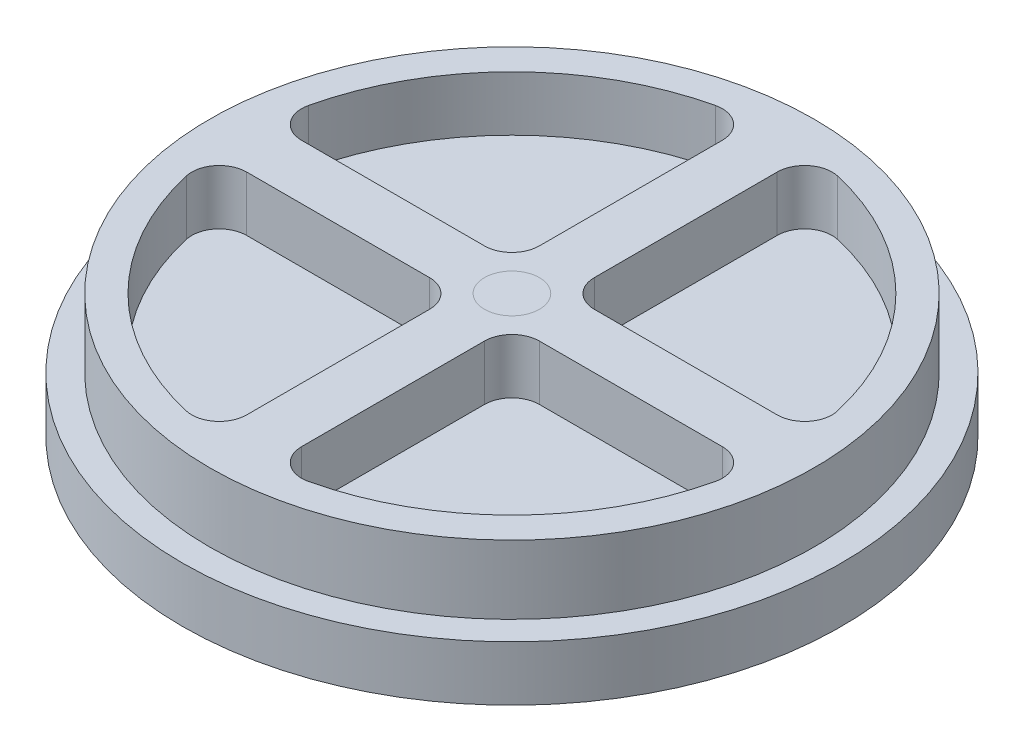
ISO-10303-21;
HEADER;
FILE_DESCRIPTION(('STEP AP214'),'2;1');
FILE_NAME('part.step','',(''),(''),'','','');
FILE_SCHEMA(('AUTOMOTIVE_DESIGN { 1 0 10303 214 1 1 1 1 }'));
ENDSEC;
DATA;
#1=APPLICATION_CONTEXT('core data for automotive mechanical design processes');
#2=APPLICATION_PROTOCOL_DEFINITION('international standard','automotive_design',2000,#1);
#3=PRODUCT_CONTEXT('',#1,'mechanical');
#4=PRODUCT('Part','Part','',(#3));
#5=PRODUCT_RELATED_PRODUCT_CATEGORY('part','',(#4));
#6=PRODUCT_DEFINITION_FORMATION('','',#4);
#7=PRODUCT_DEFINITION_CONTEXT('part definition',#1,'design');
#8=PRODUCT_DEFINITION('design','',#6,#7);
#9=PRODUCT_DEFINITION_SHAPE('','',#8);
#10=(LENGTH_UNIT() NAMED_UNIT(*) SI_UNIT(.MILLI.,.METRE.));
#11=(NAMED_UNIT(*) PLANE_ANGLE_UNIT() SI_UNIT($,.RADIAN.));
#12=(NAMED_UNIT(*) SI_UNIT($,.STERADIAN.) SOLID_ANGLE_UNIT());
#13=UNCERTAINTY_MEASURE_WITH_UNIT(LENGTH_MEASURE(1.E-05),#10,'distance_accuracy_value','');
#14=(GEOMETRIC_REPRESENTATION_CONTEXT(3) GLOBAL_UNCERTAINTY_ASSIGNED_CONTEXT((#13)) GLOBAL_UNIT_ASSIGNED_CONTEXT((#10,
#11,#12)) REPRESENTATION_CONTEXT('',''));
#15=CARTESIAN_POINT('',(0.,0.,0.));
#16=DIRECTION('',(0.,0.,1.));
#17=DIRECTION('',(1.,0.,0.));
#18=AXIS2_PLACEMENT_3D('',#15,#16,#17);
#19=CARTESIAN_POINT('',(0.,63.5,25.4));
#20=DIRECTION('',(0.,0.,1.));
#21=DIRECTION('',(1.,0.,0.));
#22=AXIS2_PLACEMENT_3D('',#19,#20,#21);
#23=PLANE('',#22);
#24=DIRECTION('',(-1.,0.,0.));
#25=VECTOR('',#24,1.);
#26=CARTESIAN_POINT('',(0.,12.7,25.4));
#27=LINE('',#26,#25);
#28=CARTESIAN_POINT('',(-50.8000000000002,12.7,25.4));
#29=VERTEX_POINT('',#28);
#30=CARTESIAN_POINT('',(-219.912108973385,12.7,25.4));
#31=VERTEX_POINT('',#30);
#32=EDGE_CURVE('E249',#29,#31,#27,.T.);
#33=ORIENTED_EDGE('',*,*,#32,.F.);
#34=DIRECTION('',(0.,-1.,0.));
#35=VECTOR('',#34,1.);
#36=CARTESIAN_POINT('',(-50.8000000000002,63.5,25.4));
#37=LINE('',#36,#35);
#38=CARTESIAN_POINT('',(-50.8000000000002,63.5,25.4));
#39=VERTEX_POINT('',#38);
#40=EDGE_CURVE('E12',#39,#29,#37,.T.);
#41=ORIENTED_EDGE('',*,*,#40,.F.);
#42=DIRECTION('',(-1.,0.,0.));
#43=VECTOR('',#42,1.);
#44=CARTESIAN_POINT('',(0.,63.5,25.4));
#45=LINE('',#44,#43);
#46=CARTESIAN_POINT('',(-219.912108973385,63.5,25.4));
#47=VERTEX_POINT('',#46);
#48=EDGE_CURVE('E377',#39,#47,#45,.T.);
#49=ORIENTED_EDGE('',*,*,#48,.T.);
#50=DIRECTION('',(0.,-1.,0.));
#51=VECTOR('',#50,1.);
#52=CARTESIAN_POINT('',(-219.912108973385,63.5,25.4));
#53=LINE('',#52,#51);
#54=EDGE_CURVE('E263',#47,#31,#53,.T.);
#55=ORIENTED_EDGE('',*,*,#54,.T.);
#56=EDGE_LOOP('',(#33,#41,#49,#55));
#57=FACE_BOUND('',#56,.T.);
#58=ADVANCED_FACE('F47',(#57),#23,.T.);
#59=CARTESIAN_POINT('',(-50.8,63.5,50.8));
#60=DIRECTION('',(0.,-1.,0.));
#61=DIRECTION('',(0.,0.,-1.));
#62=AXIS2_PLACEMENT_3D('',#59,#60,#61);
#63=CYLINDRICAL_SURFACE('',#62,25.4);
#64=CARTESIAN_POINT('',(-50.8,12.7,50.8));
#65=DIRECTION('',(0.,1.,0.));
#66=DIRECTION('',(0.,0.,1.));
#67=AXIS2_PLACEMENT_3D('',#64,#65,#66);
#68=CIRCLE('',#67,25.4);
#69=CARTESIAN_POINT('',(-25.4,12.7,50.8000000000002));
#70=VERTEX_POINT('',#69);
#71=EDGE_CURVE('E252',#29,#70,#68,.F.);
#72=ORIENTED_EDGE('',*,*,#71,.T.);
#73=DIRECTION('',(0.,-1.,0.));
#74=VECTOR('',#73,1.);
#75=CARTESIAN_POINT('',(-25.4,63.5,50.8000000000002));
#76=LINE('',#75,#74);
#77=CARTESIAN_POINT('',(-25.4,63.5,50.8000000000002));
#78=VERTEX_POINT('',#77);
#79=EDGE_CURVE('E57',#78,#70,#76,.T.);
#80=ORIENTED_EDGE('',*,*,#79,.F.);
#81=CARTESIAN_POINT('',(-50.8,63.5,50.8));
#82=DIRECTION('',(0.,1.,0.));
#83=DIRECTION('',(0.,0.,1.));
#84=AXIS2_PLACEMENT_3D('',#81,#82,#83);
#85=CIRCLE('',#84,25.4);
#86=EDGE_CURVE('E191',#39,#78,#85,.F.);
#87=ORIENTED_EDGE('',*,*,#86,.F.);
#88=ORIENTED_EDGE('',*,*,#40,.T.);
#89=EDGE_LOOP('',(#72,#80,#87,#88));
#90=FACE_BOUND('',#89,.T.);
#91=ADVANCED_FACE('F374',(#90),#63,.F.);
#92=CARTESIAN_POINT('',(-25.4,63.5,0.));
#93=DIRECTION('',(-1.,0.,0.));
#94=DIRECTION('',(0.,0.,1.));
#95=AXIS2_PLACEMENT_3D('',#92,#93,#94);
#96=PLANE('',#95);
#97=DIRECTION('',(0.,0.,-1.));
#98=VECTOR('',#97,1.);
#99=CARTESIAN_POINT('',(-25.4,12.7,0.));
#100=LINE('',#99,#98);
#101=CARTESIAN_POINT('',(-25.4,12.7,219.912108973386));
#102=VERTEX_POINT('',#101);
#103=EDGE_CURVE('E92',#102,#70,#100,.T.);
#104=ORIENTED_EDGE('',*,*,#103,.F.);
#105=DIRECTION('',(0.,-1.,0.));
#106=VECTOR('',#105,1.);
#107=CARTESIAN_POINT('',(-25.4,63.5,219.912108973386));
#108=LINE('',#107,#106);
#109=CARTESIAN_POINT('',(-25.4,63.5,219.912108973386));
#110=VERTEX_POINT('',#109);
#111=EDGE_CURVE('E178',#110,#102,#108,.T.);
#112=ORIENTED_EDGE('',*,*,#111,.F.);
#113=DIRECTION('',(0.,0.,-1.));
#114=VECTOR('',#113,1.);
#115=CARTESIAN_POINT('',(-25.4,63.5,0.));
#116=LINE('',#115,#114);
#117=EDGE_CURVE('E189',#110,#78,#116,.T.);
#118=ORIENTED_EDGE('',*,*,#117,.T.);
#119=ORIENTED_EDGE('',*,*,#79,.T.);
#120=EDGE_LOOP('',(#104,#112,#118,#119));
#121=FACE_BOUND('',#120,.T.);
#122=ADVANCED_FACE('F381',(#121),#96,.T.);
#123=CARTESIAN_POINT('',(-50.8,63.5,219.912108973386));
#124=DIRECTION('',(0.,-1.,0.));
#125=DIRECTION('',(0.,0.,-1.));
#126=AXIS2_PLACEMENT_3D('',#123,#124,#125);
#127=CYLINDRICAL_SURFACE('',#126,25.4);
#128=CARTESIAN_POINT('',(-50.8,12.7,219.912108973386));
#129=DIRECTION('',(0.,1.,0.));
#130=DIRECTION('',(0.,0.,1.));
#131=AXIS2_PLACEMENT_3D('',#128,#129,#130);
#132=CIRCLE('',#131,25.4);
#133=CARTESIAN_POINT('',(-56.5168860629134,12.7,244.660385958737));
#134=VERTEX_POINT('',#133);
#135=EDGE_CURVE('E175',#134,#102,#132,.T.);
#136=ORIENTED_EDGE('',*,*,#135,.F.);
#137=DIRECTION('',(0.,-1.,0.));
#138=VECTOR('',#137,1.);
#139=CARTESIAN_POINT('',(-56.5168860629134,63.5,244.660385958737));
#140=LINE('',#139,#138);
#141=CARTESIAN_POINT('',(-56.5168860629134,63.5,244.660385958737));
#142=VERTEX_POINT('',#141);
#143=EDGE_CURVE('E168',#142,#134,#140,.T.);
#144=ORIENTED_EDGE('',*,*,#143,.F.);
#145=CARTESIAN_POINT('',(-50.8,63.5,219.912108973386));
#146=DIRECTION('',(0.,1.,0.));
#147=DIRECTION('',(0.,0.,1.));
#148=AXIS2_PLACEMENT_3D('',#145,#146,#147);
#149=CIRCLE('',#148,25.4);
#150=EDGE_CURVE('E173',#142,#110,#149,.T.);
#151=ORIENTED_EDGE('',*,*,#150,.T.);
#152=ORIENTED_EDGE('',*,*,#111,.T.);
#153=EDGE_LOOP('',(#136,#144,#151,#152));
#154=FACE_BOUND('',#153,.T.);
#155=ADVANCED_FACE('F170',(#154),#127,.F.);
#156=CARTESIAN_POINT('',(0.,63.5,0.));
#157=DIRECTION('',(0.,-1.,0.));
#158=DIRECTION('',(0.,0.,-1.));
#159=AXIS2_PLACEMENT_3D('',#156,#157,#158);
#160=CYLINDRICAL_SURFACE('',#159,251.103291232366);
#161=CARTESIAN_POINT('',(0.,12.7,0.));
#162=DIRECTION('',(0.,1.,0.));
#163=DIRECTION('',(0.,0.,1.));
#164=AXIS2_PLACEMENT_3D('',#161,#162,#163);
#165=CIRCLE('',#164,251.103291232366);
#166=CARTESIAN_POINT('',(-244.660385958737,12.7,56.5168860629135));
#167=VERTEX_POINT('',#166);
#168=EDGE_CURVE('E257',#134,#167,#165,.F.);
#169=ORIENTED_EDGE('',*,*,#168,.T.);
#170=DIRECTION('',(0.,-1.,0.));
#171=VECTOR('',#170,1.);
#172=CARTESIAN_POINT('',(-244.660385958737,63.5,56.5168860629135));
#173=LINE('',#172,#171);
#174=CARTESIAN_POINT('',(-244.660385958737,63.5,56.5168860629135));
#175=VERTEX_POINT('',#174);
#176=EDGE_CURVE('E179',#175,#167,#173,.T.);
#177=ORIENTED_EDGE('',*,*,#176,.F.);
#178=CARTESIAN_POINT('',(0.,63.5,0.));
#179=DIRECTION('',(0.,1.,0.));
#180=DIRECTION('',(0.,0.,1.));
#181=AXIS2_PLACEMENT_3D('',#178,#179,#180);
#182=CIRCLE('',#181,251.103291232366);
#183=EDGE_CURVE('E182',#142,#175,#182,.F.);
#184=ORIENTED_EDGE('',*,*,#183,.F.);
#185=ORIENTED_EDGE('',*,*,#143,.T.);
#186=EDGE_LOOP('',(#169,#177,#184,#185));
#187=FACE_BOUND('',#186,.T.);
#188=ADVANCED_FACE('F183',(#187),#160,.F.);
#189=CARTESIAN_POINT('',(-219.912108973385,63.5,-50.8000000000007));
#190=DIRECTION('',(0.,-1.,0.));
#191=DIRECTION('',(0.,0.,-1.));
#192=AXIS2_PLACEMENT_3D('',#189,#190,#191);
#193=CYLINDRICAL_SURFACE('',#192,25.4);
#194=CARTESIAN_POINT('',(-219.912108973385,12.7,-50.8000000000007));
#195=DIRECTION('',(0.,1.,0.));
#196=DIRECTION('',(0.,0.,1.));
#197=AXIS2_PLACEMENT_3D('',#194,#195,#196);
#198=CIRCLE('',#197,25.4);
#199=CARTESIAN_POINT('',(-244.660385958737,12.7,-56.5168860629141));
#200=VERTEX_POINT('',#199);
#201=CARTESIAN_POINT('',(-219.912108973385,12.7,-25.4000000000007));
#202=VERTEX_POINT('',#201);
#203=EDGE_CURVE('E234',#200,#202,#198,.T.);
#204=ORIENTED_EDGE('',*,*,#203,.F.);
#205=DIRECTION('',(0.,-1.,0.));
#206=VECTOR('',#205,1.);
#207=CARTESIAN_POINT('',(-244.660385958737,63.5,-56.5168860629141));
#208=LINE('',#207,#206);
#209=CARTESIAN_POINT('',(-244.660385958737,63.5,-56.5168860629141));
#210=VERTEX_POINT('',#209);
#211=EDGE_CURVE('E266',#210,#200,#208,.T.);
#212=ORIENTED_EDGE('',*,*,#211,.F.);
#213=CARTESIAN_POINT('',(-219.912108973385,63.5,-50.8000000000007));
#214=DIRECTION('',(0.,1.,0.));
#215=DIRECTION('',(0.,0.,1.));
#216=AXIS2_PLACEMENT_3D('',#213,#214,#215);
#217=CIRCLE('',#216,25.4);
#218=CARTESIAN_POINT('',(-219.912108973385,63.5,-25.4000000000007));
#219=VERTEX_POINT('',#218);
#220=EDGE_CURVE('E749',#210,#219,#217,.T.);
#221=ORIENTED_EDGE('',*,*,#220,.T.);
#222=DIRECTION('',(0.,-1.,0.));
#223=VECTOR('',#222,1.);
#224=CARTESIAN_POINT('',(-219.912108973385,63.5,-25.4000000000007));
#225=LINE('',#224,#223);
#226=EDGE_CURVE('E270',#219,#202,#225,.T.);
#227=ORIENTED_EDGE('',*,*,#226,.T.);
#228=EDGE_LOOP('',(#204,#212,#221,#227));
#229=FACE_BOUND('',#228,.T.);
#230=ADVANCED_FACE('F425',(#229),#193,.F.);
#231=CARTESIAN_POINT('',(0.,63.5,0.));
#232=DIRECTION('',(0.,-1.,0.));
#233=DIRECTION('',(0.,0.,-1.));
#234=AXIS2_PLACEMENT_3D('',#231,#232,#233);
#235=CYLINDRICAL_SURFACE('',#234,251.103291232366);
#236=CARTESIAN_POINT('',(0.,12.7,0.));
#237=DIRECTION('',(0.,1.,0.));
#238=DIRECTION('',(0.,0.,1.));
#239=AXIS2_PLACEMENT_3D('',#236,#237,#238);
#240=CIRCLE('',#239,251.103291232366);
#241=CARTESIAN_POINT('',(-56.5168860629127,12.7,-244.660385958737));
#242=VERTEX_POINT('',#241);
#243=EDGE_CURVE('E237',#200,#242,#240,.F.);
#244=ORIENTED_EDGE('',*,*,#243,.T.);
#245=DIRECTION('',(0.,-1.,0.));
#246=VECTOR('',#245,1.);
#247=CARTESIAN_POINT('',(-56.5168860629127,63.5,-244.660385958737));
#248=LINE('',#247,#246);
#249=CARTESIAN_POINT('',(-56.5168860629127,63.5,-244.660385958737));
#250=VERTEX_POINT('',#249);
#251=EDGE_CURVE('E283',#250,#242,#248,.T.);
#252=ORIENTED_EDGE('',*,*,#251,.F.);
#253=CARTESIAN_POINT('',(0.,63.5,0.));
#254=DIRECTION('',(0.,1.,0.));
#255=DIRECTION('',(0.,0.,1.));
#256=AXIS2_PLACEMENT_3D('',#253,#254,#255);
#257=CIRCLE('',#256,251.103291232366);
#258=EDGE_CURVE('E752',#210,#250,#257,.F.);
#259=ORIENTED_EDGE('',*,*,#258,.F.);
#260=ORIENTED_EDGE('',*,*,#211,.T.);
#261=EDGE_LOOP('',(#244,#252,#259,#260));
#262=FACE_BOUND('',#261,.T.);
#263=ADVANCED_FACE('F421',(#262),#235,.F.);
#264=CARTESIAN_POINT('',(-50.7999999999993,63.5,-219.912108973386));
#265=DIRECTION('',(0.,-1.,0.));
#266=DIRECTION('',(0.,0.,-1.));
#267=AXIS2_PLACEMENT_3D('',#264,#265,#266);
#268=CYLINDRICAL_SURFACE('',#267,25.4);
#269=CARTESIAN_POINT('',(-50.7999999999993,12.7,-219.912108973386));
#270=DIRECTION('',(0.,1.,0.));
#271=DIRECTION('',(0.,0.,1.));
#272=AXIS2_PLACEMENT_3D('',#269,#270,#271);
#273=CIRCLE('',#272,25.4);
#274=CARTESIAN_POINT('',(-25.3999999999993,12.7,-219.912108973386));
#275=VERTEX_POINT('',#274);
#276=EDGE_CURVE('E84',#242,#275,#273,.F.);
#277=ORIENTED_EDGE('',*,*,#276,.T.);
#278=DIRECTION('',(0.,-1.,0.));
#279=VECTOR('',#278,1.);
#280=CARTESIAN_POINT('',(-25.3999999999993,63.5,-219.912108973386));
#281=LINE('',#280,#279);
#282=CARTESIAN_POINT('',(-25.3999999999993,63.5,-219.912108973386));
#283=VERTEX_POINT('',#282);
#284=EDGE_CURVE('E280',#283,#275,#281,.T.);
#285=ORIENTED_EDGE('',*,*,#284,.F.);
#286=CARTESIAN_POINT('',(-50.7999999999993,63.5,-219.912108973386));
#287=DIRECTION('',(0.,1.,0.));
#288=DIRECTION('',(0.,0.,1.));
#289=AXIS2_PLACEMENT_3D('',#286,#287,#288);
#290=CIRCLE('',#289,25.4);
#291=EDGE_CURVE('E755',#250,#283,#290,.F.);
#292=ORIENTED_EDGE('',*,*,#291,.F.);
#293=ORIENTED_EDGE('',*,*,#251,.T.);
#294=EDGE_LOOP('',(#277,#285,#292,#293));
#295=FACE_BOUND('',#294,.T.);
#296=ADVANCED_FACE('F417',(#295),#268,.F.);
#297=CARTESIAN_POINT('',(-25.4,63.5,0.));
#298=DIRECTION('',(-1.,0.,0.));
#299=DIRECTION('',(0.,0.,1.));
#300=AXIS2_PLACEMENT_3D('',#297,#298,#299);
#301=PLANE('',#300);
#302=DIRECTION('',(0.,0.,-1.));
#303=VECTOR('',#302,1.);
#304=CARTESIAN_POINT('',(-25.4,12.7,0.));
#305=LINE('',#304,#303);
#306=CARTESIAN_POINT('',(-25.3999999999998,12.7,-50.8000000000002));
#307=VERTEX_POINT('',#306);
#308=EDGE_CURVE('E241',#307,#275,#305,.T.);
#309=ORIENTED_EDGE('',*,*,#308,.F.);
#310=DIRECTION('',(0.,-1.,0.));
#311=VECTOR('',#310,1.);
#312=CARTESIAN_POINT('',(-25.3999999999998,63.5,-50.8000000000002));
#313=LINE('',#312,#311);
#314=CARTESIAN_POINT('',(-25.3999999999998,63.5,-50.8000000000002));
#315=VERTEX_POINT('',#314);
#316=EDGE_CURVE('E277',#315,#307,#313,.T.);
#317=ORIENTED_EDGE('',*,*,#316,.F.);
#318=DIRECTION('',(0.,0.,-1.));
#319=VECTOR('',#318,1.);
#320=CARTESIAN_POINT('',(-25.4,63.5,0.));
#321=LINE('',#320,#319);
#322=EDGE_CURVE('E757',#315,#283,#321,.T.);
#323=ORIENTED_EDGE('',*,*,#322,.T.);
#324=ORIENTED_EDGE('',*,*,#284,.T.);
#325=EDGE_LOOP('',(#309,#317,#323,#324));
#326=FACE_BOUND('',#325,.T.);
#327=ADVANCED_FACE('F413',(#326),#301,.T.);
#328=CARTESIAN_POINT('',(-50.7999999999998,63.5,-50.8000000000002));
#329=DIRECTION('',(0.,-1.,0.));
#330=DIRECTION('',(0.,0.,-1.));
#331=AXIS2_PLACEMENT_3D('',#328,#329,#330);
#332=CYLINDRICAL_SURFACE('',#331,25.4);
#333=CARTESIAN_POINT('',(-50.7999999999998,12.7,-50.8000000000002));
#334=DIRECTION('',(0.,1.,0.));
#335=DIRECTION('',(0.,0.,1.));
#336=AXIS2_PLACEMENT_3D('',#333,#334,#335);
#337=CIRCLE('',#336,25.4);
#338=CARTESIAN_POINT('',(-50.8000000000001,12.7,-25.4000000000001));
#339=VERTEX_POINT('',#338);
#340=EDGE_CURVE('E243',#307,#339,#337,.F.);
#341=ORIENTED_EDGE('',*,*,#340,.T.);
#342=DIRECTION('',(0.,-1.,0.));
#343=VECTOR('',#342,1.);
#344=CARTESIAN_POINT('',(-50.8000000000001,63.5,-25.4000000000001));
#345=LINE('',#344,#343);
#346=CARTESIAN_POINT('',(-50.8000000000001,63.5,-25.4000000000001));
#347=VERTEX_POINT('',#346);
#348=EDGE_CURVE('E273',#347,#339,#345,.T.);
#349=ORIENTED_EDGE('',*,*,#348,.F.);
#350=CARTESIAN_POINT('',(-50.7999999999998,63.5,-50.8000000000002));
#351=DIRECTION('',(0.,1.,0.));
#352=DIRECTION('',(0.,0.,1.));
#353=AXIS2_PLACEMENT_3D('',#350,#351,#352);
#354=CIRCLE('',#353,25.4);
#355=EDGE_CURVE('E760',#315,#347,#354,.F.);
#356=ORIENTED_EDGE('',*,*,#355,.F.);
#357=ORIENTED_EDGE('',*,*,#316,.T.);
#358=EDGE_LOOP('',(#341,#349,#356,#357));
#359=FACE_BOUND('',#358,.T.);
#360=ADVANCED_FACE('F409',(#359),#332,.F.);
#361=CARTESIAN_POINT('',(50.8000000000015,63.5,-219.912108973385));
#362=DIRECTION('',(0.,-1.,0.));
#363=DIRECTION('',(0.,0.,-1.));
#364=AXIS2_PLACEMENT_3D('',#361,#362,#363);
#365=CYLINDRICAL_SURFACE('',#364,25.4);
#366=CARTESIAN_POINT('',(50.8000000000015,12.7,-219.912108973385));
#367=DIRECTION('',(0.,1.,0.));
#368=DIRECTION('',(0.,0.,1.));
#369=AXIS2_PLACEMENT_3D('',#366,#367,#368);
#370=CIRCLE('',#369,25.4);
#371=CARTESIAN_POINT('',(56.5168860629151,12.7,-244.660385958736));
#372=VERTEX_POINT('',#371);
#373=CARTESIAN_POINT('',(25.4000000000015,12.7,-219.912108973385));
#374=VERTEX_POINT('',#373);
#375=EDGE_CURVE('E216',#372,#374,#370,.T.);
#376=ORIENTED_EDGE('',*,*,#375,.F.);
#377=DIRECTION('',(0.,-1.,0.));
#378=VECTOR('',#377,1.);
#379=CARTESIAN_POINT('',(56.5168860629151,63.5,-244.660385958736));
#380=LINE('',#379,#378);
#381=CARTESIAN_POINT('',(56.5168860629151,63.5,-244.660385958736));
#382=VERTEX_POINT('',#381);
#383=EDGE_CURVE('E274',#382,#372,#380,.T.);
#384=ORIENTED_EDGE('',*,*,#383,.F.);
#385=CARTESIAN_POINT('',(50.8000000000015,63.5,-219.912108973385));
#386=DIRECTION('',(0.,1.,0.));
#387=DIRECTION('',(0.,0.,1.));
#388=AXIS2_PLACEMENT_3D('',#385,#386,#387);
#389=CIRCLE('',#388,25.4);
#390=CARTESIAN_POINT('',(25.4000000000015,63.5,-219.912108973385));
#391=VERTEX_POINT('',#390);
#392=EDGE_CURVE('E733',#382,#391,#389,.T.);
#393=ORIENTED_EDGE('',*,*,#392,.T.);
#394=DIRECTION('',(0.,-1.,0.));
#395=VECTOR('',#394,1.);
#396=CARTESIAN_POINT('',(25.4000000000015,63.5,-219.912108973385));
#397=LINE('',#396,#395);
#398=EDGE_CURVE('E287',#391,#374,#397,.T.);
#399=ORIENTED_EDGE('',*,*,#398,.T.);
#400=EDGE_LOOP('',(#376,#384,#393,#399));
#401=FACE_BOUND('',#400,.T.);
#402=ADVANCED_FACE('F412',(#401),#365,.F.);
#403=CARTESIAN_POINT('',(0.,63.5,0.));
#404=DIRECTION('',(0.,-1.,0.));
#405=DIRECTION('',(0.,0.,-1.));
#406=AXIS2_PLACEMENT_3D('',#403,#404,#405);
#407=CYLINDRICAL_SURFACE('',#406,251.103291232366);
#408=CARTESIAN_POINT('',(0.,12.7,0.));
#409=DIRECTION('',(0.,1.,0.));
#410=DIRECTION('',(0.,0.,1.));
#411=AXIS2_PLACEMENT_3D('',#408,#409,#410);
#412=CIRCLE('',#411,251.103291232366);
#413=CARTESIAN_POINT('',(244.660385958737,12.7,-56.5168860629118));
#414=VERTEX_POINT('',#413);
#415=EDGE_CURVE('E219',#372,#414,#412,.F.);
#416=ORIENTED_EDGE('',*,*,#415,.T.);
#417=DIRECTION('',(0.,-1.,0.));
#418=VECTOR('',#417,1.);
#419=CARTESIAN_POINT('',(244.660385958737,63.5,-56.5168860629118));
#420=LINE('',#419,#418);
#421=CARTESIAN_POINT('',(244.660385958737,63.5,-56.5168860629118));
#422=VERTEX_POINT('',#421);
#423=EDGE_CURVE('E299',#422,#414,#420,.T.);
#424=ORIENTED_EDGE('',*,*,#423,.F.);
#425=CARTESIAN_POINT('',(0.,63.5,0.));
#426=DIRECTION('',(0.,1.,0.));
#427=DIRECTION('',(0.,0.,1.));
#428=AXIS2_PLACEMENT_3D('',#425,#426,#427);
#429=CIRCLE('',#428,251.103291232366);
#430=EDGE_CURVE('E736',#382,#422,#429,.F.);
#431=ORIENTED_EDGE('',*,*,#430,.F.);
#432=ORIENTED_EDGE('',*,*,#383,.T.);
#433=EDGE_LOOP('',(#416,#424,#431,#432));
#434=FACE_BOUND('',#433,.T.);
#435=ADVANCED_FACE('F445',(#434),#407,.F.);
#436=CARTESIAN_POINT('',(219.912108973386,63.5,-50.7999999999985));
#437=DIRECTION('',(0.,-1.,0.));
#438=DIRECTION('',(0.,0.,-1.));
#439=AXIS2_PLACEMENT_3D('',#436,#437,#438);
#440=CYLINDRICAL_SURFACE('',#439,25.4);
#441=CARTESIAN_POINT('',(219.912108973386,12.7,-50.7999999999985));
#442=DIRECTION('',(0.,1.,0.));
#443=DIRECTION('',(0.,0.,1.));
#444=AXIS2_PLACEMENT_3D('',#441,#442,#443);
#445=CIRCLE('',#444,25.4);
#446=CARTESIAN_POINT('',(219.912108973386,12.7,-25.3999999999985));
#447=VERTEX_POINT('',#446);
#448=EDGE_CURVE('E222',#414,#447,#445,.F.);
#449=ORIENTED_EDGE('',*,*,#448,.T.);
#450=DIRECTION('',(0.,-1.,0.));
#451=VECTOR('',#450,1.);
#452=CARTESIAN_POINT('',(219.912108973386,63.5,-25.3999999999985));
#453=LINE('',#452,#451);
#454=CARTESIAN_POINT('',(219.912108973386,63.5,-25.3999999999985));
#455=VERTEX_POINT('',#454);
#456=EDGE_CURVE('E296',#455,#447,#453,.T.);
#457=ORIENTED_EDGE('',*,*,#456,.F.);
#458=CARTESIAN_POINT('',(219.912108973386,63.5,-50.7999999999985));
#459=DIRECTION('',(0.,1.,0.));
#460=DIRECTION('',(0.,0.,1.));
#461=AXIS2_PLACEMENT_3D('',#458,#459,#460);
#462=CIRCLE('',#461,25.4);
#463=EDGE_CURVE('E739',#422,#455,#462,.F.);
#464=ORIENTED_EDGE('',*,*,#463,.F.);
#465=ORIENTED_EDGE('',*,*,#423,.T.);
#466=EDGE_LOOP('',(#449,#457,#464,#465));
#467=FACE_BOUND('',#466,.T.);
#468=ADVANCED_FACE('F441',(#467),#440,.F.);
#469=CARTESIAN_POINT('',(1.7560996784687E-13,63.5,-25.4));
#470=DIRECTION('',(0.,0.,-1.));
#471=DIRECTION('',(-1.,0.,0.));
#472=AXIS2_PLACEMENT_3D('',#469,#470,#471);
#473=PLANE('',#472);
#474=DIRECTION('',(1.,0.,0.));
#475=VECTOR('',#474,1.);
#476=CARTESIAN_POINT('',(1.7560996784687E-13,12.7,-25.4));
#477=LINE('',#476,#475);
#478=CARTESIAN_POINT('',(50.8000000000003,12.7,-25.3999999999997));
#479=VERTEX_POINT('',#478);
#480=EDGE_CURVE('E225',#479,#447,#477,.T.);
#481=ORIENTED_EDGE('',*,*,#480,.F.);
#482=DIRECTION('',(0.,-1.,0.));
#483=VECTOR('',#482,1.);
#484=CARTESIAN_POINT('',(50.8000000000003,63.5,-25.3999999999997));
#485=LINE('',#484,#483);
#486=CARTESIAN_POINT('',(50.8000000000003,63.5,-25.3999999999997));
#487=VERTEX_POINT('',#486);
#488=EDGE_CURVE('E293',#487,#479,#485,.T.);
#489=ORIENTED_EDGE('',*,*,#488,.F.);
#490=DIRECTION('',(1.,0.,0.));
#491=VECTOR('',#490,1.);
#492=CARTESIAN_POINT('',(1.7560996784687E-13,63.5,-25.4));
#493=LINE('',#492,#491);
#494=EDGE_CURVE('E741',#487,#455,#493,.T.);
#495=ORIENTED_EDGE('',*,*,#494,.T.);
#496=ORIENTED_EDGE('',*,*,#456,.T.);
#497=EDGE_LOOP('',(#481,#489,#495,#496));
#498=FACE_BOUND('',#497,.T.);
#499=ADVANCED_FACE('F437',(#498),#473,.T.);
#500=CARTESIAN_POINT('',(50.8000000000003,63.5,-50.7999999999996));
#501=DIRECTION('',(0.,-1.,0.));
#502=DIRECTION('',(0.,0.,-1.));
#503=AXIS2_PLACEMENT_3D('',#500,#501,#502);
#504=CYLINDRICAL_SURFACE('',#503,25.4);
#505=CARTESIAN_POINT('',(50.8000000000003,12.7,-50.7999999999996));
#506=DIRECTION('',(0.,1.,0.));
#507=DIRECTION('',(0.,0.,1.));
#508=AXIS2_PLACEMENT_3D('',#505,#506,#507);
#509=CIRCLE('',#508,25.4);
#510=CARTESIAN_POINT('',(25.4000000000003,12.7,-50.8));
#511=VERTEX_POINT('',#510);
#512=EDGE_CURVE('E228',#479,#511,#509,.F.);
#513=ORIENTED_EDGE('',*,*,#512,.T.);
#514=DIRECTION('',(0.,-1.,0.));
#515=VECTOR('',#514,1.);
#516=CARTESIAN_POINT('',(25.4000000000003,63.5,-50.8));
#517=LINE('',#516,#515);
#518=CARTESIAN_POINT('',(25.4000000000003,63.5,-50.8));
#519=VERTEX_POINT('',#518);
#520=EDGE_CURVE('E290',#519,#511,#517,.T.);
#521=ORIENTED_EDGE('',*,*,#520,.F.);
#522=CARTESIAN_POINT('',(50.8000000000003,63.5,-50.7999999999996));
#523=DIRECTION('',(0.,1.,0.));
#524=DIRECTION('',(0.,0.,1.));
#525=AXIS2_PLACEMENT_3D('',#522,#523,#524);
#526=CIRCLE('',#525,25.4);
#527=EDGE_CURVE('E744',#487,#519,#526,.F.);
#528=ORIENTED_EDGE('',*,*,#527,.F.);
#529=ORIENTED_EDGE('',*,*,#488,.T.);
#530=EDGE_LOOP('',(#513,#521,#528,#529));
#531=FACE_BOUND('',#530,.T.);
#532=ADVANCED_FACE('F434',(#531),#504,.F.);
#533=CARTESIAN_POINT('',(219.912108973385,63.5,50.8000000000023));
#534=DIRECTION('',(0.,-1.,0.));
#535=DIRECTION('',(0.,0.,-1.));
#536=AXIS2_PLACEMENT_3D('',#533,#534,#535);
#537=CYLINDRICAL_SURFACE('',#536,25.4);
#538=CARTESIAN_POINT('',(219.912108973385,12.7,50.8000000000023));
#539=DIRECTION('',(0.,1.,0.));
#540=DIRECTION('',(0.,0.,1.));
#541=AXIS2_PLACEMENT_3D('',#538,#539,#540);
#542=CIRCLE('',#541,25.4);
#543=CARTESIAN_POINT('',(244.660385958736,12.7,56.5168860629159));
#544=VERTEX_POINT('',#543);
#545=CARTESIAN_POINT('',(219.912108973385,12.7,25.4000000000023));
#546=VERTEX_POINT('',#545);
#547=EDGE_CURVE('E197',#544,#546,#542,.T.);
#548=ORIENTED_EDGE('',*,*,#547,.F.);
#549=DIRECTION('',(0.,-1.,0.));
#550=VECTOR('',#549,1.);
#551=CARTESIAN_POINT('',(244.660385958736,63.5,56.5168860629159));
#552=LINE('',#551,#550);
#553=CARTESIAN_POINT('',(244.660385958736,63.5,56.5168860629159));
#554=VERTEX_POINT('',#553);
#555=EDGE_CURVE('E51',#554,#544,#552,.T.);
#556=ORIENTED_EDGE('',*,*,#555,.F.);
#557=CARTESIAN_POINT('',(219.912108973385,63.5,50.8000000000023));
#558=DIRECTION('',(0.,1.,0.));
#559=DIRECTION('',(0.,0.,1.));
#560=AXIS2_PLACEMENT_3D('',#557,#558,#559);
#561=CIRCLE('',#560,25.4);
#562=CARTESIAN_POINT('',(219.912108973385,63.5,25.4000000000023));
#563=VERTEX_POINT('',#562);
#564=EDGE_CURVE('E262',#554,#563,#561,.T.);
#565=ORIENTED_EDGE('',*,*,#564,.T.);
#566=DIRECTION('',(0.,-1.,0.));
#567=VECTOR('',#566,1.);
#568=CARTESIAN_POINT('',(219.912108973385,63.5,25.4000000000023));
#569=LINE('',#568,#567);
#570=EDGE_CURVE('E196',#563,#546,#569,.T.);
#571=ORIENTED_EDGE('',*,*,#570,.T.);
#572=EDGE_LOOP('',(#548,#556,#565,#571));
#573=FACE_BOUND('',#572,.T.);
#574=ADVANCED_FACE('F49',(#573),#537,.F.);
#575=CARTESIAN_POINT('',(0.,63.5,0.));
#576=DIRECTION('',(0.,-1.,0.));
#577=DIRECTION('',(0.,0.,-1.));
#578=AXIS2_PLACEMENT_3D('',#575,#576,#577);
#579=CYLINDRICAL_SURFACE('',#578,251.103291232366);
#580=CARTESIAN_POINT('',(0.,12.7,0.));
#581=DIRECTION('',(0.,1.,0.));
#582=DIRECTION('',(0.,0.,1.));
#583=AXIS2_PLACEMENT_3D('',#580,#581,#582);
#584=CIRCLE('',#583,251.103291232366);
#585=CARTESIAN_POINT('',(56.5168860629109,12.7,244.660385958737));
#586=VERTEX_POINT('',#585);
#587=EDGE_CURVE('E200',#544,#586,#584,.F.);
#588=ORIENTED_EDGE('',*,*,#587,.T.);
#589=DIRECTION('',(0.,-1.,0.));
#590=VECTOR('',#589,1.);
#591=CARTESIAN_POINT('',(56.5168860629109,63.5,244.660385958737));
#592=LINE('',#591,#590);
#593=CARTESIAN_POINT('',(56.5168860629109,63.5,244.660385958737));
#594=VERTEX_POINT('',#593);
#595=EDGE_CURVE('E314',#594,#586,#592,.T.);
#596=ORIENTED_EDGE('',*,*,#595,.F.);
#597=CARTESIAN_POINT('',(0.,63.5,0.));
#598=DIRECTION('',(0.,1.,0.));
#599=DIRECTION('',(0.,0.,1.));
#600=AXIS2_PLACEMENT_3D('',#597,#598,#599);
#601=CIRCLE('',#600,251.103291232366);
#602=EDGE_CURVE('E323',#554,#594,#601,.F.);
#603=ORIENTED_EDGE('',*,*,#602,.F.);
#604=ORIENTED_EDGE('',*,*,#555,.T.);
#605=EDGE_LOOP('',(#588,#596,#603,#604));
#606=FACE_BOUND('',#605,.T.);
#607=ADVANCED_FACE('F321',(#606),#579,.F.);
#608=CARTESIAN_POINT('',(50.7999999999977,63.5,219.912108973386));
#609=DIRECTION('',(0.,-1.,0.));
#610=DIRECTION('',(0.,0.,-1.));
#611=AXIS2_PLACEMENT_3D('',#608,#609,#610);
#612=CYLINDRICAL_SURFACE('',#611,25.4);
#613=CARTESIAN_POINT('',(50.7999999999977,12.7,219.912108973386));
#614=DIRECTION('',(0.,1.,0.));
#615=DIRECTION('',(0.,0.,1.));
#616=AXIS2_PLACEMENT_3D('',#613,#614,#615);
#617=CIRCLE('',#616,25.4);
#618=CARTESIAN_POINT('',(25.3999999999977,12.7,219.912108973386));
#619=VERTEX_POINT('',#618);
#620=EDGE_CURVE('E204',#586,#619,#617,.F.);
#621=ORIENTED_EDGE('',*,*,#620,.T.);
#622=DIRECTION('',(0.,-1.,0.));
#623=VECTOR('',#622,1.);
#624=CARTESIAN_POINT('',(25.3999999999977,63.5,219.912108973386));
#625=LINE('',#624,#623);
#626=CARTESIAN_POINT('',(25.3999999999977,63.5,219.912108973386));
#627=VERTEX_POINT('',#626);
#628=EDGE_CURVE('E312',#627,#619,#625,.T.);
#629=ORIENTED_EDGE('',*,*,#628,.F.);
#630=CARTESIAN_POINT('',(50.7999999999977,63.5,219.912108973386));
#631=DIRECTION('',(0.,1.,0.));
#632=DIRECTION('',(0.,0.,1.));
#633=AXIS2_PLACEMENT_3D('',#630,#631,#632);
#634=CIRCLE('',#633,25.4);
#635=EDGE_CURVE('E723',#594,#627,#634,.F.);
#636=ORIENTED_EDGE('',*,*,#635,.F.);
#637=ORIENTED_EDGE('',*,*,#595,.T.);
#638=EDGE_LOOP('',(#621,#629,#636,#637));
#639=FACE_BOUND('',#638,.T.);
#640=ADVANCED_FACE('F462',(#639),#612,.F.);
#641=CARTESIAN_POINT('',(25.4,63.5,2.64196598511463E-13));
#642=DIRECTION('',(1.,0.,0.));
#643=DIRECTION('',(0.,0.,-1.));
#644=AXIS2_PLACEMENT_3D('',#641,#642,#643);
#645=PLANE('',#644);
#646=DIRECTION('',(0.,0.,1.));
#647=VECTOR('',#646,1.);
#648=CARTESIAN_POINT('',(25.4,12.7,2.64196598511463E-13));
#649=LINE('',#648,#647);
#650=CARTESIAN_POINT('',(25.3999999999995,12.7,50.8000000000004));
#651=VERTEX_POINT('',#650);
#652=EDGE_CURVE('E207',#651,#619,#649,.T.);
#653=ORIENTED_EDGE('',*,*,#652,.F.);
#654=DIRECTION('',(0.,-1.,0.));
#655=VECTOR('',#654,1.);
#656=CARTESIAN_POINT('',(25.3999999999995,63.5,50.8000000000004));
#657=LINE('',#656,#655);
#658=CARTESIAN_POINT('',(25.3999999999995,63.5,50.8000000000004));
#659=VERTEX_POINT('',#658);
#660=EDGE_CURVE('E309',#659,#651,#657,.T.);
#661=ORIENTED_EDGE('',*,*,#660,.F.);
#662=DIRECTION('',(0.,0.,1.));
#663=VECTOR('',#662,1.);
#664=CARTESIAN_POINT('',(25.4,63.5,2.64196598511463E-13));
#665=LINE('',#664,#663);
#666=EDGE_CURVE('E725',#659,#627,#665,.T.);
#667=ORIENTED_EDGE('',*,*,#666,.T.);
#668=ORIENTED_EDGE('',*,*,#628,.T.);
#669=EDGE_LOOP('',(#653,#661,#667,#668));
#670=FACE_BOUND('',#669,.T.);
#671=ADVANCED_FACE('F458',(#670),#645,.T.);
#672=CARTESIAN_POINT('',(50.7999999999995,63.5,50.8000000000005));
#673=DIRECTION('',(0.,-1.,0.));
#674=DIRECTION('',(0.,0.,-1.));
#675=AXIS2_PLACEMENT_3D('',#672,#673,#674);
#676=CYLINDRICAL_SURFACE('',#675,25.4);
#677=CARTESIAN_POINT('',(50.7999999999995,12.7,50.8000000000005));
#678=DIRECTION('',(0.,1.,0.));
#679=DIRECTION('',(0.,0.,1.));
#680=AXIS2_PLACEMENT_3D('',#677,#678,#679);
#681=CIRCLE('',#680,25.4);
#682=CARTESIAN_POINT('',(50.7999999999999,12.7,25.4000000000005));
#683=VERTEX_POINT('',#682);
#684=EDGE_CURVE('E210',#651,#683,#681,.F.);
#685=ORIENTED_EDGE('',*,*,#684,.T.);
#686=DIRECTION('',(0.,-1.,0.));
#687=VECTOR('',#686,1.);
#688=CARTESIAN_POINT('',(50.7999999999999,63.5,25.4000000000005));
#689=LINE('',#688,#687);
#690=CARTESIAN_POINT('',(50.7999999999999,63.5,25.4000000000005));
#691=VERTEX_POINT('',#690);
#692=EDGE_CURVE('E306',#691,#683,#689,.T.);
#693=ORIENTED_EDGE('',*,*,#692,.F.);
#694=CARTESIAN_POINT('',(50.7999999999995,63.5,50.8000000000005));
#695=DIRECTION('',(0.,1.,0.));
#696=DIRECTION('',(0.,0.,1.));
#697=AXIS2_PLACEMENT_3D('',#694,#695,#696);
#698=CIRCLE('',#697,25.4);
#699=EDGE_CURVE('E728',#659,#691,#698,.F.);
#700=ORIENTED_EDGE('',*,*,#699,.F.);
#701=ORIENTED_EDGE('',*,*,#660,.T.);
#702=EDGE_LOOP('',(#685,#693,#700,#701));
#703=FACE_BOUND('',#702,.T.);
#704=ADVANCED_FACE('F399',(#703),#676,.F.);
#705=CARTESIAN_POINT('',(0.,63.5,0.));
#706=DIRECTION('',(0.,-1.,0.));
#707=DIRECTION('',(0.,0.,-1.));
#708=AXIS2_PLACEMENT_3D('',#705,#706,#707);
#709=CYLINDRICAL_SURFACE('',#708,279.4);
#710=CARTESIAN_POINT('',(0.,63.5,0.));
#711=DIRECTION('',(0.,1.,0.));
#712=DIRECTION('',(0.,0.,1.));
#713=AXIS2_PLACEMENT_3D('',#710,#711,#712);
#714=CIRCLE('',#713,279.4);
#715=CARTESIAN_POINT('',(0.,63.5,279.4));
#716=VERTEX_POINT('',#715);
#717=EDGE_CURVE('E768',#716,#716,#714,.T.);
#718=ORIENTED_EDGE('',*,*,#717,.F.);
#719=EDGE_LOOP('',(#718));
#720=FACE_BOUND('',#719,.T.);
#721=CARTESIAN_POINT('',(0.,0.,0.));
#722=DIRECTION('',(0.,1.,0.));
#723=DIRECTION('',(0.,0.,1.));
#724=AXIS2_PLACEMENT_3D('',#721,#722,#723);
#725=CIRCLE('',#724,279.4);
#726=CARTESIAN_POINT('',(0.,0.,279.4));
#727=VERTEX_POINT('',#726);
#728=EDGE_CURVE('E201',#727,#727,#725,.T.);
#729=ORIENTED_EDGE('',*,*,#728,.T.);
#730=EDGE_LOOP('',(#729));
#731=FACE_BOUND('',#730,.T.);
#732=ADVANCED_FACE('F395',(#720,#731),#709,.T.);
#733=CARTESIAN_POINT('',(0.,63.5,0.));
#734=DIRECTION('',(0.,-1.,0.));
#735=DIRECTION('',(0.,0.,-1.));
#736=AXIS2_PLACEMENT_3D('',#733,#734,#735);
#737=CYLINDRICAL_SURFACE('',#736,25.4);
#738=CARTESIAN_POINT('',(0.,63.5,0.));
#739=DIRECTION('',(0.,1.,0.));
#740=DIRECTION('',(0.,0.,1.));
#741=AXIS2_PLACEMENT_3D('',#738,#739,#740);
#742=CIRCLE('',#741,25.4);
#743=CARTESIAN_POINT('',(0.,63.5,25.4));
#744=VERTEX_POINT('',#743);
#745=EDGE_CURVE('E765',#744,#744,#742,.F.);
#746=ORIENTED_EDGE('',*,*,#745,.F.);
#747=EDGE_LOOP('',(#746));
#748=FACE_BOUND('',#747,.T.);
#749=CARTESIAN_POINT('',(0.,0.,0.));
#750=DIRECTION('',(0.,1.,0.));
#751=DIRECTION('',(0.,0.,1.));
#752=AXIS2_PLACEMENT_3D('',#749,#750,#751);
#753=CIRCLE('',#752,25.4);
#754=CARTESIAN_POINT('',(0.,0.,25.4));
#755=VERTEX_POINT('',#754);
#756=EDGE_CURVE('E716',#755,#755,#753,.T.);
#757=ORIENTED_EDGE('',*,*,#756,.F.);
#758=EDGE_LOOP('',(#757));
#759=FACE_BOUND('',#758,.T.);
#760=ADVANCED_FACE('F398',(#748,#759),#737,.F.);
#761=CARTESIAN_POINT('',(0.,63.5,-25.4));
#762=DIRECTION('',(0.,0.,-1.));
#763=DIRECTION('',(-1.,0.,0.));
#764=AXIS2_PLACEMENT_3D('',#761,#762,#763);
#765=PLANE('',#764);
#766=DIRECTION('',(1.,0.,0.));
#767=VECTOR('',#766,1.);
#768=CARTESIAN_POINT('',(0.,12.7,-25.4));
#769=LINE('',#768,#767);
#770=EDGE_CURVE('E246',#202,#339,#769,.T.);
#771=ORIENTED_EDGE('',*,*,#770,.F.);
#772=ORIENTED_EDGE('',*,*,#226,.F.);
#773=DIRECTION('',(1.,0.,0.));
#774=VECTOR('',#773,1.);
#775=CARTESIAN_POINT('',(0.,63.5,-25.4));
#776=LINE('',#775,#774);
#777=EDGE_CURVE('E762',#219,#347,#776,.T.);
#778=ORIENTED_EDGE('',*,*,#777,.T.);
#779=ORIENTED_EDGE('',*,*,#348,.T.);
#780=EDGE_LOOP('',(#771,#772,#778,#779));
#781=FACE_BOUND('',#780,.T.);
#782=ADVANCED_FACE('F403',(#781),#765,.T.);
#783=CARTESIAN_POINT('',(25.4,63.5,1.77173261329186E-13));
#784=DIRECTION('',(1.,0.,0.));
#785=DIRECTION('',(0.,0.,-1.));
#786=AXIS2_PLACEMENT_3D('',#783,#784,#785);
#787=PLANE('',#786);
#788=DIRECTION('',(0.,0.,1.));
#789=VECTOR('',#788,1.);
#790=CARTESIAN_POINT('',(25.4,12.7,1.77173261329186E-13));
#791=LINE('',#790,#789);
#792=EDGE_CURVE('E231',#374,#511,#791,.T.);
#793=ORIENTED_EDGE('',*,*,#792,.F.);
#794=ORIENTED_EDGE('',*,*,#398,.F.);
#795=DIRECTION('',(0.,0.,1.));
#796=VECTOR('',#795,1.);
#797=CARTESIAN_POINT('',(25.4,63.5,1.77173261329186E-13));
#798=LINE('',#797,#796);
#799=EDGE_CURVE('E746',#391,#519,#798,.T.);
#800=ORIENTED_EDGE('',*,*,#799,.T.);
#801=ORIENTED_EDGE('',*,*,#520,.T.);
#802=EDGE_LOOP('',(#793,#794,#800,#801));
#803=FACE_BOUND('',#802,.T.);
#804=ADVANCED_FACE('F407',(#803),#787,.T.);
#805=CARTESIAN_POINT('',(-2.65759891993779E-13,63.5,25.4));
#806=DIRECTION('',(0.,0.,1.));
#807=DIRECTION('',(1.,0.,0.));
#808=AXIS2_PLACEMENT_3D('',#805,#806,#807);
#809=PLANE('',#808);
#810=DIRECTION('',(-1.,0.,0.));
#811=VECTOR('',#810,1.);
#812=CARTESIAN_POINT('',(-2.65759891993779E-13,12.7,25.4));
#813=LINE('',#812,#811);
#814=EDGE_CURVE('E213',#546,#683,#813,.T.);
#815=ORIENTED_EDGE('',*,*,#814,.F.);
#816=ORIENTED_EDGE('',*,*,#570,.F.);
#817=DIRECTION('',(-1.,0.,0.));
#818=VECTOR('',#817,1.);
#819=CARTESIAN_POINT('',(-2.65759891993779E-13,63.5,25.4));
#820=LINE('',#819,#818);
#821=EDGE_CURVE('E730',#563,#691,#820,.T.);
#822=ORIENTED_EDGE('',*,*,#821,.T.);
#823=ORIENTED_EDGE('',*,*,#692,.T.);
#824=EDGE_LOOP('',(#815,#816,#822,#823));
#825=FACE_BOUND('',#824,.T.);
#826=ADVANCED_FACE('F432',(#825),#809,.T.);
#827=CARTESIAN_POINT('',(-219.912108973385,63.5,50.8));
#828=DIRECTION('',(0.,-1.,0.));
#829=DIRECTION('',(0.,0.,-1.));
#830=AXIS2_PLACEMENT_3D('',#827,#828,#829);
#831=CYLINDRICAL_SURFACE('',#830,25.4);
#832=CARTESIAN_POINT('',(-219.912108973385,12.7,50.8));
#833=DIRECTION('',(0.,1.,0.));
#834=DIRECTION('',(0.,0.,1.));
#835=AXIS2_PLACEMENT_3D('',#832,#833,#834);
#836=CIRCLE('',#835,25.4);
#837=EDGE_CURVE('E259',#167,#31,#836,.F.);
#838=ORIENTED_EDGE('',*,*,#837,.T.);
#839=ORIENTED_EDGE('',*,*,#54,.F.);
#840=CARTESIAN_POINT('',(-219.912108973385,63.5,50.8));
#841=DIRECTION('',(0.,1.,0.));
#842=DIRECTION('',(0.,0.,1.));
#843=AXIS2_PLACEMENT_3D('',#840,#841,#842);
#844=CIRCLE('',#843,25.4);
#845=EDGE_CURVE('E66',#175,#47,#844,.F.);
#846=ORIENTED_EDGE('',*,*,#845,.F.);
#847=ORIENTED_EDGE('',*,*,#176,.T.);
#848=EDGE_LOOP('',(#838,#839,#846,#847));
#849=FACE_BOUND('',#848,.T.);
#850=ADVANCED_FACE('F379',(#849),#831,.F.);
#851=CARTESIAN_POINT('',(0.,63.5,0.));
#852=DIRECTION('',(0.,1.,0.));
#853=DIRECTION('',(0.,0.,1.));
#854=AXIS2_PLACEMENT_3D('',#851,#852,#853);
#855=PLANE('',#854);
#856=ORIENTED_EDGE('',*,*,#564,.F.);
#857=ORIENTED_EDGE('',*,*,#602,.T.);
#858=ORIENTED_EDGE('',*,*,#635,.T.);
#859=ORIENTED_EDGE('',*,*,#666,.F.);
#860=ORIENTED_EDGE('',*,*,#699,.T.);
#861=ORIENTED_EDGE('',*,*,#821,.F.);
#862=EDGE_LOOP('',(#856,#857,#858,#859,#860,#861));
#863=FACE_BOUND('',#862,.T.);
#864=ORIENTED_EDGE('',*,*,#392,.F.);
#865=ORIENTED_EDGE('',*,*,#430,.T.);
#866=ORIENTED_EDGE('',*,*,#463,.T.);
#867=ORIENTED_EDGE('',*,*,#494,.F.);
#868=ORIENTED_EDGE('',*,*,#527,.T.);
#869=ORIENTED_EDGE('',*,*,#799,.F.);
#870=EDGE_LOOP('',(#864,#865,#866,#867,#868,#869));
#871=FACE_BOUND('',#870,.T.);
#872=ORIENTED_EDGE('',*,*,#220,.F.);
#873=ORIENTED_EDGE('',*,*,#258,.T.);
#874=ORIENTED_EDGE('',*,*,#291,.T.);
#875=ORIENTED_EDGE('',*,*,#322,.F.);
#876=ORIENTED_EDGE('',*,*,#355,.T.);
#877=ORIENTED_EDGE('',*,*,#777,.F.);
#878=EDGE_LOOP('',(#872,#873,#874,#875,#876,#877));
#879=FACE_BOUND('',#878,.T.);
#880=ORIENTED_EDGE('',*,*,#745,.T.);
#881=EDGE_LOOP('',(#880));
#882=FACE_BOUND('',#881,.T.);
#883=ORIENTED_EDGE('',*,*,#717,.T.);
#884=EDGE_LOOP('',(#883));
#885=FACE_BOUND('',#884,.T.);
#886=ORIENTED_EDGE('',*,*,#48,.F.);
#887=ORIENTED_EDGE('',*,*,#86,.T.);
#888=ORIENTED_EDGE('',*,*,#117,.F.);
#889=ORIENTED_EDGE('',*,*,#150,.F.);
#890=ORIENTED_EDGE('',*,*,#183,.T.);
#891=ORIENTED_EDGE('',*,*,#845,.T.);
#892=EDGE_LOOP('',(#886,#887,#888,#889,#890,#891));
#893=FACE_BOUND('',#892,.T.);
#894=ADVANCED_FACE('F187',(#863,#871,#879,#882,#885,#893),#855,.T.);
#895=CARTESIAN_POINT('',(0.,12.7,0.));
#896=DIRECTION('',(0.,1.,0.));
#897=DIRECTION('',(0.,0.,1.));
#898=AXIS2_PLACEMENT_3D('',#895,#896,#897);
#899=PLANE('',#898);
#900=ORIENTED_EDGE('',*,*,#71,.F.);
#901=ORIENTED_EDGE('',*,*,#32,.T.);
#902=ORIENTED_EDGE('',*,*,#837,.F.);
#903=ORIENTED_EDGE('',*,*,#168,.F.);
#904=ORIENTED_EDGE('',*,*,#135,.T.);
#905=ORIENTED_EDGE('',*,*,#103,.T.);
#906=EDGE_LOOP('',(#900,#901,#902,#903,#904,#905));
#907=FACE_BOUND('',#906,.T.);
#908=ADVANCED_FACE('F369',(#907),#899,.T.);
#909=ORIENTED_EDGE('',*,*,#243,.F.);
#910=ORIENTED_EDGE('',*,*,#203,.T.);
#911=ORIENTED_EDGE('',*,*,#770,.T.);
#912=ORIENTED_EDGE('',*,*,#340,.F.);
#913=ORIENTED_EDGE('',*,*,#308,.T.);
#914=ORIENTED_EDGE('',*,*,#276,.F.);
#915=EDGE_LOOP('',(#909,#910,#911,#912,#913,#914));
#916=FACE_BOUND('',#915,.T.);
#917=ADVANCED_FACE('F572',(#916),#899,.T.);
#918=ORIENTED_EDGE('',*,*,#415,.F.);
#919=ORIENTED_EDGE('',*,*,#375,.T.);
#920=ORIENTED_EDGE('',*,*,#792,.T.);
#921=ORIENTED_EDGE('',*,*,#512,.F.);
#922=ORIENTED_EDGE('',*,*,#480,.T.);
#923=ORIENTED_EDGE('',*,*,#448,.F.);
#924=EDGE_LOOP('',(#918,#919,#920,#921,#922,#923));
#925=FACE_BOUND('',#924,.T.);
#926=ADVANCED_FACE('F562',(#925),#899,.T.);
#927=ORIENTED_EDGE('',*,*,#587,.F.);
#928=ORIENTED_EDGE('',*,*,#547,.T.);
#929=ORIENTED_EDGE('',*,*,#814,.T.);
#930=ORIENTED_EDGE('',*,*,#684,.F.);
#931=ORIENTED_EDGE('',*,*,#652,.T.);
#932=ORIENTED_EDGE('',*,*,#620,.F.);
#933=EDGE_LOOP('',(#927,#928,#929,#930,#931,#932));
#934=FACE_BOUND('',#933,.T.);
#935=ADVANCED_FACE('F330',(#934),#899,.T.);
#936=CARTESIAN_POINT('',(0.,0.,0.));
#937=DIRECTION('',(0.,1.,0.));
#938=DIRECTION('',(0.,0.,1.));
#939=AXIS2_PLACEMENT_3D('',#936,#937,#938);
#940=PLANE('',#939);
#941=ORIENTED_EDGE('',*,*,#728,.F.);
#942=EDGE_LOOP('',(#941));
#943=FACE_BOUND('',#942,.T.);
#944=ORIENTED_EDGE('',*,*,#756,.T.);
#945=EDGE_LOOP('',(#944));
#946=FACE_BOUND('',#945,.T.);
#947=ADVANCED_FACE('F561',(#943,#946),#940,.F.);
#948=CLOSED_SHELL('',(#58,#91,#122,#155,#188,#230,#263,#296,#327,#360,#402,#435,#468,#499,#532,
#574,#607,#640,#671,#704,#732,#760,#782,#804,#826,#850,#894,#908,#917,#926,#935,#947));
#949=MANIFOLD_SOLID_BREP('B2',#948);
#950=CARTESIAN_POINT('',(0.,-50.8,0.));
#951=DIRECTION('',(0.,1.,0.));
#952=DIRECTION('',(0.,0.,1.));
#953=AXIS2_PLACEMENT_3D('',#950,#951,#952);
#954=CYLINDRICAL_SURFACE('',#953,304.8);
#955=CARTESIAN_POINT('',(0.,-50.8,0.));
#956=DIRECTION('',(0.,1.,0.));
#957=DIRECTION('',(0.,0.,1.));
#958=AXIS2_PLACEMENT_3D('',#955,#956,#957);
#959=CIRCLE('',#958,304.8);
#960=CARTESIAN_POINT('',(0.,-50.8,304.8));
#961=VERTEX_POINT('',#960);
#962=EDGE_CURVE('E46',#961,#961,#959,.T.);
#963=ORIENTED_EDGE('',*,*,#962,.T.);
#964=EDGE_LOOP('',(#963));
#965=FACE_BOUND('',#964,.T.);
#966=CARTESIAN_POINT('',(0.,0.,0.));
#967=DIRECTION('',(0.,1.,0.));
#968=DIRECTION('',(0.,0.,1.));
#969=AXIS2_PLACEMENT_3D('',#966,#967,#968);
#970=CIRCLE('',#969,304.8);
#971=CARTESIAN_POINT('',(0.,0.,304.8));
#972=VERTEX_POINT('',#971);
#973=EDGE_CURVE('E812',#972,#972,#970,.T.);
#974=ORIENTED_EDGE('',*,*,#973,.F.);
#975=EDGE_LOOP('',(#974));
#976=FACE_BOUND('',#975,.T.);
#977=ADVANCED_FACE('F809',(#965,#976),#954,.T.);
#978=CARTESIAN_POINT('',(0.,-50.8,0.));
#979=DIRECTION('',(0.,1.,0.));
#980=DIRECTION('',(0.,0.,1.));
#981=AXIS2_PLACEMENT_3D('',#978,#979,#980);
#982=PLANE('',#981);
#983=ORIENTED_EDGE('',*,*,#962,.F.);
#984=EDGE_LOOP('',(#983));
#985=FACE_BOUND('',#984,.T.);
#986=ADVANCED_FACE('F838',(#985),#982,.F.);
#987=CARTESIAN_POINT('',(0.,0.,0.));
#988=DIRECTION('',(0.,1.,0.));
#989=DIRECTION('',(0.,0.,1.));
#990=AXIS2_PLACEMENT_3D('',#987,#988,#989);
#991=PLANE('',#990);
#992=CARTESIAN_POINT('',(0.,0.,0.));
#993=DIRECTION('',(0.,1.,0.));
#994=DIRECTION('',(0.,0.,1.));
#995=AXIS2_PLACEMENT_3D('',#992,#993,#994);
#996=CIRCLE('',#995,25.4);
#997=CARTESIAN_POINT('',(0.,0.,25.4));
#998=VERTEX_POINT('',#997);
#999=EDGE_CURVE('E821',#998,#998,#996,.T.);
#1000=ORIENTED_EDGE('',*,*,#999,.F.);
#1001=EDGE_LOOP('',(#1000));
#1002=FACE_BOUND('',#1001,.T.);
#1003=ORIENTED_EDGE('',*,*,#973,.T.);
#1004=EDGE_LOOP('',(#1003));
#1005=FACE_BOUND('',#1004,.T.);
#1006=ADVANCED_FACE('F832',(#1002,#1005),#991,.T.);
#1007=CARTESIAN_POINT('',(0.,63.5,0.));
#1008=DIRECTION('',(0.,-1.,0.));
#1009=DIRECTION('',(0.,0.,-1.));
#1010=AXIS2_PLACEMENT_3D('',#1007,#1008,#1009);
#1011=CYLINDRICAL_SURFACE('',#1010,25.4);
#1012=CARTESIAN_POINT('',(0.,63.5,0.));
#1013=DIRECTION('',(0.,1.,0.));
#1014=DIRECTION('',(0.,0.,1.));
#1015=AXIS2_PLACEMENT_3D('',#1012,#1013,#1014);
#1016=CIRCLE('',#1015,25.4);
#1017=CARTESIAN_POINT('',(0.,63.5,25.4));
#1018=VERTEX_POINT('',#1017);
#1019=EDGE_CURVE('E819',#1018,#1018,#1016,.T.);
#1020=ORIENTED_EDGE('',*,*,#1019,.F.);
#1021=EDGE_LOOP('',(#1020));
#1022=FACE_BOUND('',#1021,.T.);
#1023=ORIENTED_EDGE('',*,*,#999,.T.);
#1024=EDGE_LOOP('',(#1023));
#1025=FACE_BOUND('',#1024,.T.);
#1026=ADVANCED_FACE('F829',(#1022,#1025),#1011,.T.);
#1027=CARTESIAN_POINT('',(0.,63.5,0.));
#1028=DIRECTION('',(0.,1.,0.));
#1029=DIRECTION('',(0.,0.,1.));
#1030=AXIS2_PLACEMENT_3D('',#1027,#1028,#1029);
#1031=PLANE('',#1030);
#1032=ORIENTED_EDGE('',*,*,#1019,.T.);
#1033=EDGE_LOOP('',(#1032));
#1034=FACE_BOUND('',#1033,.T.);
#1035=ADVANCED_FACE('F827',(#1034),#1031,.T.);
#1036=CLOSED_SHELL('',(#977,#986,#1006,#1026,#1035));
#1037=MANIFOLD_SOLID_BREP('B6',#1036);
#1038=ADVANCED_BREP_SHAPE_REPRESENTATION('',(#18,#949,#1037),#14);
#1039=SHAPE_DEFINITION_REPRESENTATION(#9,#1038);
ENDSEC;
END-ISO-10303-21;
